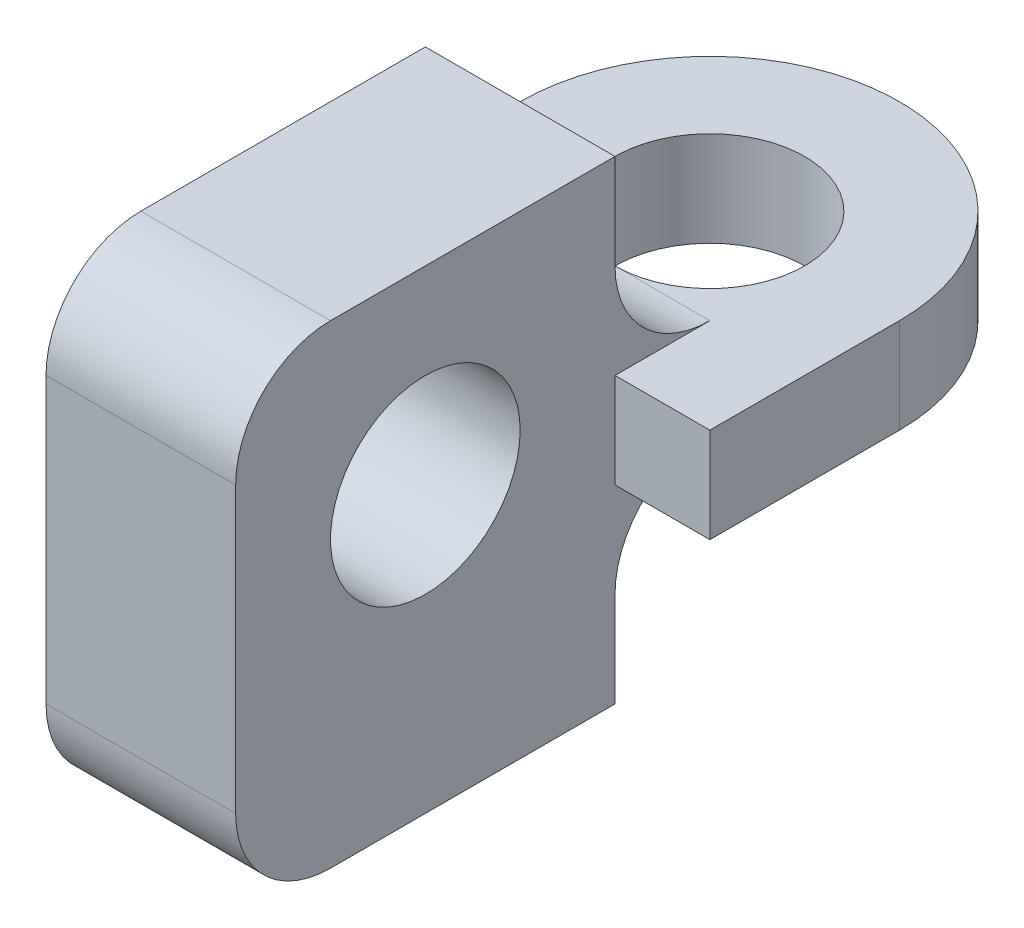
ISO-10303-21;
HEADER;
FILE_DESCRIPTION(('STEP AP214'),'2;1');
FILE_NAME('part.step','',(''),(''),'','','');
FILE_SCHEMA(('AUTOMOTIVE_DESIGN { 1 0 10303 214 1 1 1 1 }'));
ENDSEC;
DATA;
#1=APPLICATION_CONTEXT('core data for automotive mechanical design processes');
#2=APPLICATION_PROTOCOL_DEFINITION('international standard','automotive_design',2000,#1);
#3=PRODUCT_CONTEXT('',#1,'mechanical');
#4=PRODUCT('Part','Part','',(#3));
#5=PRODUCT_RELATED_PRODUCT_CATEGORY('part','',(#4));
#6=PRODUCT_DEFINITION_FORMATION('','',#4);
#7=PRODUCT_DEFINITION_CONTEXT('part definition',#1,'design');
#8=PRODUCT_DEFINITION('design','',#6,#7);
#9=PRODUCT_DEFINITION_SHAPE('','',#8);
#10=(LENGTH_UNIT() NAMED_UNIT(*) SI_UNIT(.MILLI.,.METRE.));
#11=(NAMED_UNIT(*) PLANE_ANGLE_UNIT() SI_UNIT($,.RADIAN.));
#12=(NAMED_UNIT(*) SI_UNIT($,.STERADIAN.) SOLID_ANGLE_UNIT());
#13=UNCERTAINTY_MEASURE_WITH_UNIT(LENGTH_MEASURE(1.E-05),#10,'distance_accuracy_value','');
#14=(GEOMETRIC_REPRESENTATION_CONTEXT(3) GLOBAL_UNCERTAINTY_ASSIGNED_CONTEXT((#13)) GLOBAL_UNIT_ASSIGNED_CONTEXT((#10,
#11,#12)) REPRESENTATION_CONTEXT('',''));
#15=CARTESIAN_POINT('',(0.,0.,0.));
#16=DIRECTION('',(0.,0.,1.));
#17=DIRECTION('',(1.,0.,0.));
#18=AXIS2_PLACEMENT_3D('',#15,#16,#17);
#19=CARTESIAN_POINT('',(20.,0.,-40.));
#20=DIRECTION('',(0.,0.,1.));
#21=DIRECTION('',(1.,0.,0.));
#22=AXIS2_PLACEMENT_3D('',#19,#20,#21);
#23=PLANE('',#22);
#24=DIRECTION('',(0.,1.,0.));
#25=VECTOR('',#24,1.);
#26=CARTESIAN_POINT('',(20.,0.,-40.));
#27=LINE('',#26,#25);
#28=CARTESIAN_POINT('',(20.,40.,-40.));
#29=VERTEX_POINT('',#28);
#30=CARTESIAN_POINT('',(20.,50.,-40.));
#31=VERTEX_POINT('',#30);
#32=EDGE_CURVE('E235',#29,#31,#27,.T.);
#33=ORIENTED_EDGE('',*,*,#32,.F.);
#34=DIRECTION('',(1.,0.,0.));
#35=VECTOR('',#34,1.);
#36=CARTESIAN_POINT('',(20.,40.,-40.));
#37=LINE('',#36,#35);
#38=CARTESIAN_POINT('',(0.,40.,-40.));
#39=VERTEX_POINT('',#38);
#40=EDGE_CURVE('E309',#29,#39,#37,.F.);
#41=ORIENTED_EDGE('',*,*,#40,.T.);
#42=DIRECTION('',(0.,1.,0.));
#43=VECTOR('',#42,1.);
#44=CARTESIAN_POINT('',(0.,0.,-40.));
#45=LINE('',#44,#43);
#46=CARTESIAN_POINT('',(0.,50.,-40.));
#47=VERTEX_POINT('',#46);
#48=EDGE_CURVE('E226',#39,#47,#45,.T.);
#49=ORIENTED_EDGE('',*,*,#48,.T.);
#50=DIRECTION('',(-1.,0.,0.));
#51=VECTOR('',#50,1.);
#52=CARTESIAN_POINT('',(20.,50.,-40.));
#53=LINE('',#52,#51);
#54=EDGE_CURVE('E290',#31,#47,#53,.T.);
#55=ORIENTED_EDGE('',*,*,#54,.F.);
#56=EDGE_LOOP('',(#33,#41,#49,#55));
#57=FACE_BOUND('',#56,.T.);
#58=ADVANCED_FACE('F43',(#57),#23,.F.);
#59=CARTESIAN_POINT('',(0.,0.,-40.));
#60=VERTEX_POINT('',#59);
#61=CARTESIAN_POINT('',(0.,10.,-40.));
#62=VERTEX_POINT('',#61);
#63=EDGE_CURVE('E251',#60,#62,#45,.T.);
#64=ORIENTED_EDGE('',*,*,#63,.T.);
#65=DIRECTION('',(1.,0.,0.));
#66=VECTOR('',#65,1.);
#67=CARTESIAN_POINT('',(20.,10.,-40.));
#68=LINE('',#67,#66);
#69=CARTESIAN_POINT('',(20.,10.,-40.));
#70=VERTEX_POINT('',#69);
#71=EDGE_CURVE('E318',#62,#70,#68,.T.);
#72=ORIENTED_EDGE('',*,*,#71,.T.);
#73=CARTESIAN_POINT('',(20.,0.,-40.));
#74=VERTEX_POINT('',#73);
#75=EDGE_CURVE('E230',#74,#70,#27,.T.);
#76=ORIENTED_EDGE('',*,*,#75,.F.);
#77=DIRECTION('',(-1.,0.,0.));
#78=VECTOR('',#77,1.);
#79=CARTESIAN_POINT('',(20.,0.,-40.));
#80=LINE('',#79,#78);
#81=EDGE_CURVE('E250',#74,#60,#80,.T.);
#82=ORIENTED_EDGE('',*,*,#81,.T.);
#83=EDGE_LOOP('',(#64,#72,#76,#82));
#84=FACE_BOUND('',#83,.T.);
#85=ADVANCED_FACE('F397',(#84),#23,.F.);
#86=CARTESIAN_POINT('',(20.,50.,-10.0000000000001));
#87=DIRECTION('',(0.,-1.,0.));
#88=DIRECTION('',(0.,0.,-1.));
#89=AXIS2_PLACEMENT_3D('',#86,#87,#88);
#90=PLANE('',#89);
#91=DIRECTION('',(0.,0.,1.));
#92=VECTOR('',#91,1.);
#93=CARTESIAN_POINT('',(0.,50.,-10.0000000000001));
#94=LINE('',#93,#92);
#95=CARTESIAN_POINT('',(0.,50.,-10.0000000000001));
#96=VERTEX_POINT('',#95);
#97=EDGE_CURVE('E255',#47,#96,#94,.T.);
#98=ORIENTED_EDGE('',*,*,#97,.T.);
#99=DIRECTION('',(-1.,0.,0.));
#100=VECTOR('',#99,1.);
#101=CARTESIAN_POINT('',(20.,50.,-10.0000000000001));
#102=LINE('',#101,#100);
#103=CARTESIAN_POINT('',(20.,50.,-10.0000000000001));
#104=VERTEX_POINT('',#103);
#105=EDGE_CURVE('E286',#104,#96,#102,.T.);
#106=ORIENTED_EDGE('',*,*,#105,.F.);
#107=DIRECTION('',(0.,0.,1.));
#108=VECTOR('',#107,1.);
#109=CARTESIAN_POINT('',(20.,50.,-10.0000000000001));
#110=LINE('',#109,#108);
#111=EDGE_CURVE('E233',#31,#104,#110,.T.);
#112=ORIENTED_EDGE('',*,*,#111,.F.);
#113=ORIENTED_EDGE('',*,*,#54,.T.);
#114=EDGE_LOOP('',(#98,#106,#112,#113));
#115=FACE_BOUND('',#114,.T.);
#116=ADVANCED_FACE('F372',(#115),#90,.F.);
#117=CARTESIAN_POINT('',(20.,40.,-10.));
#118=DIRECTION('',(-1.,0.,0.));
#119=DIRECTION('',(0.,0.,1.));
#120=AXIS2_PLACEMENT_3D('',#117,#118,#119);
#121=CYLINDRICAL_SURFACE('',#120,10.);
#122=CARTESIAN_POINT('',(0.,40.,-10.));
#123=DIRECTION('',(1.,0.,0.));
#124=DIRECTION('',(0.,0.,-1.));
#125=AXIS2_PLACEMENT_3D('',#122,#123,#124);
#126=CIRCLE('',#125,10.);
#127=CARTESIAN_POINT('',(0.,39.9999999999999,0.));
#128=VERTEX_POINT('',#127);
#129=EDGE_CURVE('E259',#96,#128,#126,.T.);
#130=ORIENTED_EDGE('',*,*,#129,.T.);
#131=DIRECTION('',(-1.,0.,0.));
#132=VECTOR('',#131,1.);
#133=CARTESIAN_POINT('',(20.,39.9999999999999,0.));
#134=LINE('',#133,#132);
#135=CARTESIAN_POINT('',(20.,39.9999999999999,0.));
#136=VERTEX_POINT('',#135);
#137=EDGE_CURVE('E282',#136,#128,#134,.T.);
#138=ORIENTED_EDGE('',*,*,#137,.F.);
#139=CARTESIAN_POINT('',(20.,40.,-10.));
#140=DIRECTION('',(1.,0.,0.));
#141=DIRECTION('',(0.,0.,-1.));
#142=AXIS2_PLACEMENT_3D('',#139,#140,#141);
#143=CIRCLE('',#142,10.);
#144=EDGE_CURVE('E238',#104,#136,#143,.T.);
#145=ORIENTED_EDGE('',*,*,#144,.F.);
#146=ORIENTED_EDGE('',*,*,#105,.T.);
#147=EDGE_LOOP('',(#130,#138,#145,#146));
#148=FACE_BOUND('',#147,.T.);
#149=ADVANCED_FACE('F379',(#148),#121,.T.);
#150=CARTESIAN_POINT('',(20.,10.0000000000001,0.));
#151=DIRECTION('',(0.,0.,-1.));
#152=DIRECTION('',(-1.,0.,0.));
#153=AXIS2_PLACEMENT_3D('',#150,#151,#152);
#154=PLANE('',#153);
#155=DIRECTION('',(0.,-1.,0.));
#156=VECTOR('',#155,1.);
#157=CARTESIAN_POINT('',(0.,10.0000000000001,0.));
#158=LINE('',#157,#156);
#159=CARTESIAN_POINT('',(0.,10.0000000000001,0.));
#160=VERTEX_POINT('',#159);
#161=EDGE_CURVE('E262',#128,#160,#158,.T.);
#162=ORIENTED_EDGE('',*,*,#161,.T.);
#163=DIRECTION('',(-1.,0.,0.));
#164=VECTOR('',#163,1.);
#165=CARTESIAN_POINT('',(20.,10.0000000000001,0.));
#166=LINE('',#165,#164);
#167=CARTESIAN_POINT('',(20.,10.0000000000001,0.));
#168=VERTEX_POINT('',#167);
#169=EDGE_CURVE('E278',#168,#160,#166,.T.);
#170=ORIENTED_EDGE('',*,*,#169,.F.);
#171=DIRECTION('',(0.,-1.,0.));
#172=VECTOR('',#171,1.);
#173=CARTESIAN_POINT('',(20.,10.0000000000001,0.));
#174=LINE('',#173,#172);
#175=EDGE_CURVE('E241',#136,#168,#174,.T.);
#176=ORIENTED_EDGE('',*,*,#175,.F.);
#177=ORIENTED_EDGE('',*,*,#137,.T.);
#178=EDGE_LOOP('',(#162,#170,#176,#177));
#179=FACE_BOUND('',#178,.T.);
#180=ADVANCED_FACE('F383',(#179),#154,.F.);
#181=CARTESIAN_POINT('',(20.,10.,-10.));
#182=DIRECTION('',(-1.,0.,0.));
#183=DIRECTION('',(0.,0.,1.));
#184=AXIS2_PLACEMENT_3D('',#181,#182,#183);
#185=CYLINDRICAL_SURFACE('',#184,10.);
#186=CARTESIAN_POINT('',(0.,10.,-10.));
#187=DIRECTION('',(1.,0.,0.));
#188=DIRECTION('',(0.,0.,-1.));
#189=AXIS2_PLACEMENT_3D('',#186,#187,#188);
#190=CIRCLE('',#189,10.);
#191=CARTESIAN_POINT('',(0.,0.,-10.0000000000001));
#192=VERTEX_POINT('',#191);
#193=EDGE_CURVE('E265',#160,#192,#190,.T.);
#194=ORIENTED_EDGE('',*,*,#193,.T.);
#195=DIRECTION('',(-1.,0.,0.));
#196=VECTOR('',#195,1.);
#197=CARTESIAN_POINT('',(20.,0.,-10.0000000000001));
#198=LINE('',#197,#196);
#199=CARTESIAN_POINT('',(20.,0.,-10.0000000000001));
#200=VERTEX_POINT('',#199);
#201=EDGE_CURVE('E274',#200,#192,#198,.T.);
#202=ORIENTED_EDGE('',*,*,#201,.F.);
#203=CARTESIAN_POINT('',(20.,10.,-10.));
#204=DIRECTION('',(1.,0.,0.));
#205=DIRECTION('',(0.,0.,-1.));
#206=AXIS2_PLACEMENT_3D('',#203,#204,#205);
#207=CIRCLE('',#206,10.);
#208=EDGE_CURVE('E244',#168,#200,#207,.T.);
#209=ORIENTED_EDGE('',*,*,#208,.F.);
#210=ORIENTED_EDGE('',*,*,#169,.T.);
#211=EDGE_LOOP('',(#194,#202,#209,#210));
#212=FACE_BOUND('',#211,.T.);
#213=ADVANCED_FACE('F388',(#212),#185,.T.);
#214=CARTESIAN_POINT('',(20.,0.,-10.0000000000001));
#215=DIRECTION('',(0.,1.,0.));
#216=DIRECTION('',(0.,0.,1.));
#217=AXIS2_PLACEMENT_3D('',#214,#215,#216);
#218=PLANE('',#217);
#219=DIRECTION('',(0.,0.,-1.));
#220=VECTOR('',#219,1.);
#221=CARTESIAN_POINT('',(0.,0.,-10.0000000000001));
#222=LINE('',#221,#220);
#223=EDGE_CURVE('E268',#192,#60,#222,.T.);
#224=ORIENTED_EDGE('',*,*,#223,.T.);
#225=ORIENTED_EDGE('',*,*,#81,.F.);
#226=DIRECTION('',(0.,0.,-1.));
#227=VECTOR('',#226,1.);
#228=CARTESIAN_POINT('',(20.,0.,-10.0000000000001));
#229=LINE('',#228,#227);
#230=EDGE_CURVE('E247',#200,#74,#229,.T.);
#231=ORIENTED_EDGE('',*,*,#230,.F.);
#232=ORIENTED_EDGE('',*,*,#201,.T.);
#233=EDGE_LOOP('',(#224,#225,#231,#232));
#234=FACE_BOUND('',#233,.T.);
#235=ADVANCED_FACE('F393',(#234),#218,.F.);
#236=CARTESIAN_POINT('',(20.,40.,-10.));
#237=DIRECTION('',(1.,0.,0.));
#238=DIRECTION('',(0.,0.,-1.));
#239=AXIS2_PLACEMENT_3D('',#236,#237,#238);
#240=PLANE('',#239);
#241=CARTESIAN_POINT('',(20.,30.,-20.));
#242=DIRECTION('',(1.,0.,0.));
#243=DIRECTION('',(0.,0.,-1.));
#244=AXIS2_PLACEMENT_3D('',#241,#242,#243);
#245=CIRCLE('',#244,10.);
#246=CARTESIAN_POINT('',(20.,30.,-30.));
#247=VERTEX_POINT('',#246);
#248=EDGE_CURVE('E215',#247,#247,#245,.T.);
#249=ORIENTED_EDGE('',*,*,#248,.F.);
#250=EDGE_LOOP('',(#249));
#251=FACE_BOUND('',#250,.T.);
#252=ORIENTED_EDGE('',*,*,#75,.T.);
#253=CARTESIAN_POINT('',(20.,10.,-50.));
#254=DIRECTION('',(1.,0.,0.));
#255=DIRECTION('',(0.,0.,-1.));
#256=AXIS2_PLACEMENT_3D('',#253,#254,#255);
#257=CIRCLE('',#256,10.);
#258=CARTESIAN_POINT('',(20.,20.,-50.));
#259=VERTEX_POINT('',#258);
#260=EDGE_CURVE('E52',#70,#259,#257,.F.);
#261=ORIENTED_EDGE('',*,*,#260,.T.);
#262=DIRECTION('',(0.,0.,-1.));
#263=VECTOR('',#262,1.);
#264=CARTESIAN_POINT('',(20.,20.,-60.));
#265=LINE('',#264,#263);
#266=CARTESIAN_POINT('',(20.,20.,-40.));
#267=VERTEX_POINT('',#266);
#268=EDGE_CURVE('E59',#267,#259,#265,.T.);
#269=ORIENTED_EDGE('',*,*,#268,.F.);
#270=CARTESIAN_POINT('',(20.,30.,-40.));
#271=VERTEX_POINT('',#270);
#272=EDGE_CURVE('E234',#267,#271,#27,.T.);
#273=ORIENTED_EDGE('',*,*,#272,.T.);
#274=DIRECTION('',(0.,0.,1.));
#275=VECTOR('',#274,1.);
#276=CARTESIAN_POINT('',(20.,30.,-10.));
#277=LINE('',#276,#275);
#278=CARTESIAN_POINT('',(20.,30.,-50.));
#279=VERTEX_POINT('',#278);
#280=EDGE_CURVE('E306',#279,#271,#277,.T.);
#281=ORIENTED_EDGE('',*,*,#280,.F.);
#282=CARTESIAN_POINT('',(20.,40.,-50.));
#283=DIRECTION('',(1.,0.,0.));
#284=DIRECTION('',(0.,0.,-1.));
#285=AXIS2_PLACEMENT_3D('',#282,#283,#284);
#286=CIRCLE('',#285,10.);
#287=EDGE_CURVE('E312',#279,#29,#286,.F.);
#288=ORIENTED_EDGE('',*,*,#287,.T.);
#289=ORIENTED_EDGE('',*,*,#32,.T.);
#290=ORIENTED_EDGE('',*,*,#111,.T.);
#291=ORIENTED_EDGE('',*,*,#144,.T.);
#292=ORIENTED_EDGE('',*,*,#175,.T.);
#293=ORIENTED_EDGE('',*,*,#208,.T.);
#294=ORIENTED_EDGE('',*,*,#230,.T.);
#295=EDGE_LOOP('',(#252,#261,#269,#273,#281,#288,#289,#290,#291,#292,#293,#294));
#296=FACE_BOUND('',#295,.T.);
#297=ADVANCED_FACE('F365',(#251,#296),#240,.T.);
#298=CARTESIAN_POINT('',(0.,40.,-10.));
#299=DIRECTION('',(1.,0.,0.));
#300=DIRECTION('',(0.,0.,-1.));
#301=AXIS2_PLACEMENT_3D('',#298,#299,#300);
#302=PLANE('',#301);
#303=CARTESIAN_POINT('',(0.,30.,-20.));
#304=DIRECTION('',(1.,0.,0.));
#305=DIRECTION('',(0.,0.,-1.));
#306=AXIS2_PLACEMENT_3D('',#303,#304,#305);
#307=CIRCLE('',#306,10.);
#308=CARTESIAN_POINT('',(0.,30.,-30.));
#309=VERTEX_POINT('',#308);
#310=EDGE_CURVE('E222',#309,#309,#307,.T.);
#311=ORIENTED_EDGE('',*,*,#310,.T.);
#312=EDGE_LOOP('',(#311));
#313=FACE_BOUND('',#312,.T.);
#314=ORIENTED_EDGE('',*,*,#63,.F.);
#315=ORIENTED_EDGE('',*,*,#223,.F.);
#316=ORIENTED_EDGE('',*,*,#193,.F.);
#317=ORIENTED_EDGE('',*,*,#161,.F.);
#318=ORIENTED_EDGE('',*,*,#129,.F.);
#319=ORIENTED_EDGE('',*,*,#97,.F.);
#320=ORIENTED_EDGE('',*,*,#48,.F.);
#321=CARTESIAN_POINT('',(0.,40.,-50.));
#322=DIRECTION('',(1.,0.,0.));
#323=DIRECTION('',(0.,0.,-1.));
#324=AXIS2_PLACEMENT_3D('',#321,#322,#323);
#325=CIRCLE('',#324,10.);
#326=CARTESIAN_POINT('',(0.,30.,-50.));
#327=VERTEX_POINT('',#326);
#328=EDGE_CURVE('E315',#39,#327,#325,.T.);
#329=ORIENTED_EDGE('',*,*,#328,.T.);
#330=DIRECTION('',(0.,0.,-1.));
#331=VECTOR('',#330,1.);
#332=CARTESIAN_POINT('',(0.,30.,-60.));
#333=LINE('',#332,#331);
#334=CARTESIAN_POINT('',(0.,30.,-40.));
#335=VERTEX_POINT('',#334);
#336=EDGE_CURVE('E294',#335,#327,#333,.T.);
#337=ORIENTED_EDGE('',*,*,#336,.F.);
#338=CARTESIAN_POINT('',(0.,20.,-40.));
#339=VERTEX_POINT('',#338);
#340=EDGE_CURVE('E256',#339,#335,#45,.T.);
#341=ORIENTED_EDGE('',*,*,#340,.F.);
#342=DIRECTION('',(0.,0.,1.));
#343=VECTOR('',#342,1.);
#344=CARTESIAN_POINT('',(0.,20.,-10.));
#345=LINE('',#344,#343);
#346=CARTESIAN_POINT('',(0.,20.,-50.));
#347=VERTEX_POINT('',#346);
#348=EDGE_CURVE('E322',#347,#339,#345,.T.);
#349=ORIENTED_EDGE('',*,*,#348,.F.);
#350=CARTESIAN_POINT('',(0.,10.,-50.));
#351=DIRECTION('',(1.,0.,0.));
#352=DIRECTION('',(0.,0.,-1.));
#353=AXIS2_PLACEMENT_3D('',#350,#351,#352);
#354=CIRCLE('',#353,10.);
#355=EDGE_CURVE('E11',#347,#62,#354,.T.);
#356=ORIENTED_EDGE('',*,*,#355,.T.);
#357=EDGE_LOOP('',(#314,#315,#316,#317,#318,#319,#320,#329,#337,#341,#349,#356));
#358=FACE_BOUND('',#357,.T.);
#359=ADVANCED_FACE('F429',(#313,#358),#302,.F.);
#360=CARTESIAN_POINT('',(0.,30.,-20.));
#361=DIRECTION('',(1.,0.,0.));
#362=DIRECTION('',(0.,0.,-1.));
#363=AXIS2_PLACEMENT_3D('',#360,#361,#362);
#364=CYLINDRICAL_SURFACE('',#363,10.);
#365=ORIENTED_EDGE('',*,*,#310,.F.);
#366=EDGE_LOOP('',(#365));
#367=FACE_BOUND('',#366,.T.);
#368=ORIENTED_EDGE('',*,*,#248,.T.);
#369=EDGE_LOOP('',(#368));
#370=FACE_BOUND('',#369,.T.);
#371=ADVANCED_FACE('F432',(#367,#370),#364,.F.);
#372=CARTESIAN_POINT('',(-10.,20.,-40.));
#373=DIRECTION('',(0.,0.,1.));
#374=DIRECTION('',(1.,0.,0.));
#375=AXIS2_PLACEMENT_3D('',#372,#373,#374);
#376=PLANE('',#375);
#377=ORIENTED_EDGE('',*,*,#272,.F.);
#378=DIRECTION('',(1.,0.,0.));
#379=VECTOR('',#378,1.);
#380=CARTESIAN_POINT('',(-10.,20.,-40.));
#381=LINE('',#380,#379);
#382=CARTESIAN_POINT('',(30.,20.,-40.));
#383=VERTEX_POINT('',#382);
#384=EDGE_CURVE('E184',#267,#383,#381,.T.);
#385=ORIENTED_EDGE('',*,*,#384,.T.);
#386=DIRECTION('',(0.,1.,0.));
#387=VECTOR('',#386,1.);
#388=CARTESIAN_POINT('',(30.,20.,-40.));
#389=LINE('',#388,#387);
#390=CARTESIAN_POINT('',(30.,30.,-40.));
#391=VERTEX_POINT('',#390);
#392=EDGE_CURVE('E216',#383,#391,#389,.T.);
#393=ORIENTED_EDGE('',*,*,#392,.T.);
#394=DIRECTION('',(1.,0.,0.));
#395=VECTOR('',#394,1.);
#396=CARTESIAN_POINT('',(-10.,30.,-40.));
#397=LINE('',#396,#395);
#398=EDGE_CURVE('E209',#271,#391,#397,.T.);
#399=ORIENTED_EDGE('',*,*,#398,.F.);
#400=EDGE_LOOP('',(#377,#385,#393,#399));
#401=FACE_BOUND('',#400,.T.);
#402=ADVANCED_FACE('F343',(#401),#376,.T.);
#403=CARTESIAN_POINT('',(10.,20.,-60.));
#404=DIRECTION('',(0.,1.,0.));
#405=DIRECTION('',(0.,0.,1.));
#406=AXIS2_PLACEMENT_3D('',#403,#404,#405);
#407=CYLINDRICAL_SURFACE('',#406,20.);
#408=CARTESIAN_POINT('',(10.,30.,-60.));
#409=DIRECTION('',(0.,1.,0.));
#410=DIRECTION('',(0.,0.,1.));
#411=AXIS2_PLACEMENT_3D('',#408,#409,#410);
#412=CIRCLE('',#411,20.);
#413=CARTESIAN_POINT('',(30.,30.,-60.));
#414=VERTEX_POINT('',#413);
#415=CARTESIAN_POINT('',(-10.,30.,-60.));
#416=VERTEX_POINT('',#415);
#417=EDGE_CURVE('E203',#414,#416,#412,.T.);
#418=ORIENTED_EDGE('',*,*,#417,.F.);
#419=DIRECTION('',(0.,1.,0.));
#420=VECTOR('',#419,1.);
#421=CARTESIAN_POINT('',(30.,20.,-60.));
#422=LINE('',#421,#420);
#423=CARTESIAN_POINT('',(30.,20.,-60.));
#424=VERTEX_POINT('',#423);
#425=EDGE_CURVE('E187',#424,#414,#422,.T.);
#426=ORIENTED_EDGE('',*,*,#425,.F.);
#427=CARTESIAN_POINT('',(10.,20.,-60.));
#428=DIRECTION('',(0.,1.,0.));
#429=DIRECTION('',(0.,0.,1.));
#430=AXIS2_PLACEMENT_3D('',#427,#428,#429);
#431=CIRCLE('',#430,20.);
#432=CARTESIAN_POINT('',(-10.,20.,-60.));
#433=VERTEX_POINT('',#432);
#434=EDGE_CURVE('E179',#424,#433,#431,.T.);
#435=ORIENTED_EDGE('',*,*,#434,.T.);
#436=DIRECTION('',(0.,1.,0.));
#437=VECTOR('',#436,1.);
#438=CARTESIAN_POINT('',(-10.,20.,-60.));
#439=LINE('',#438,#437);
#440=EDGE_CURVE('E160',#433,#416,#439,.T.);
#441=ORIENTED_EDGE('',*,*,#440,.T.);
#442=EDGE_LOOP('',(#418,#426,#435,#441));
#443=FACE_BOUND('',#442,.T.);
#444=ADVANCED_FACE('F186',(#443),#407,.T.);
#445=CARTESIAN_POINT('',(30.,20.,-40.));
#446=DIRECTION('',(1.,0.,0.));
#447=DIRECTION('',(0.,0.,-1.));
#448=AXIS2_PLACEMENT_3D('',#445,#446,#447);
#449=PLANE('',#448);
#450=DIRECTION('',(0.,0.,-1.));
#451=VECTOR('',#450,1.);
#452=CARTESIAN_POINT('',(30.,30.,-40.));
#453=LINE('',#452,#451);
#454=EDGE_CURVE('E189',#391,#414,#453,.T.);
#455=ORIENTED_EDGE('',*,*,#454,.F.);
#456=ORIENTED_EDGE('',*,*,#392,.F.);
#457=DIRECTION('',(0.,0.,-1.));
#458=VECTOR('',#457,1.);
#459=CARTESIAN_POINT('',(30.,20.,-40.));
#460=LINE('',#459,#458);
#461=EDGE_CURVE('E172',#383,#424,#460,.T.);
#462=ORIENTED_EDGE('',*,*,#461,.T.);
#463=ORIENTED_EDGE('',*,*,#425,.T.);
#464=EDGE_LOOP('',(#455,#456,#462,#463));
#465=FACE_BOUND('',#464,.T.);
#466=ADVANCED_FACE('F347',(#465),#449,.T.);
#467=CARTESIAN_POINT('',(-10.,20.,-40.));
#468=VERTEX_POINT('',#467);
#469=EDGE_CURVE('E182',#468,#339,#381,.T.);
#470=ORIENTED_EDGE('',*,*,#469,.T.);
#471=ORIENTED_EDGE('',*,*,#340,.T.);
#472=CARTESIAN_POINT('',(-10.,30.,-40.));
#473=VERTEX_POINT('',#472);
#474=EDGE_CURVE('E193',#473,#335,#397,.T.);
#475=ORIENTED_EDGE('',*,*,#474,.F.);
#476=DIRECTION('',(0.,1.,0.));
#477=VECTOR('',#476,1.);
#478=CARTESIAN_POINT('',(-10.,20.,-40.));
#479=LINE('',#478,#477);
#480=EDGE_CURVE('E171',#468,#473,#479,.T.);
#481=ORIENTED_EDGE('',*,*,#480,.F.);
#482=EDGE_LOOP('',(#470,#471,#475,#481));
#483=FACE_BOUND('',#482,.T.);
#484=ADVANCED_FACE('F444',(#483),#376,.T.);
#485=CARTESIAN_POINT('',(-10.,20.,-60.));
#486=DIRECTION('',(-1.,0.,0.));
#487=DIRECTION('',(0.,0.,1.));
#488=AXIS2_PLACEMENT_3D('',#485,#486,#487);
#489=PLANE('',#488);
#490=DIRECTION('',(0.,0.,1.));
#491=VECTOR('',#490,1.);
#492=CARTESIAN_POINT('',(-10.,30.,-60.));
#493=LINE('',#492,#491);
#494=EDGE_CURVE('E165',#416,#473,#493,.T.);
#495=ORIENTED_EDGE('',*,*,#494,.F.);
#496=ORIENTED_EDGE('',*,*,#440,.F.);
#497=DIRECTION('',(0.,0.,1.));
#498=VECTOR('',#497,1.);
#499=CARTESIAN_POINT('',(-10.,20.,-60.));
#500=LINE('',#499,#498);
#501=EDGE_CURVE('E163',#433,#468,#500,.T.);
#502=ORIENTED_EDGE('',*,*,#501,.T.);
#503=ORIENTED_EDGE('',*,*,#480,.T.);
#504=EDGE_LOOP('',(#495,#496,#502,#503));
#505=FACE_BOUND('',#504,.T.);
#506=ADVANCED_FACE('F162',(#505),#489,.T.);
#507=CARTESIAN_POINT('',(10.,20.,-60.));
#508=DIRECTION('',(0.,1.,0.));
#509=DIRECTION('',(0.,0.,1.));
#510=AXIS2_PLACEMENT_3D('',#507,#508,#509);
#511=PLANE('',#510);
#512=ORIENTED_EDGE('',*,*,#384,.F.);
#513=ORIENTED_EDGE('',*,*,#268,.T.);
#514=DIRECTION('',(1.,0.,0.));
#515=VECTOR('',#514,1.);
#516=CARTESIAN_POINT('',(0.,20.,-50.));
#517=LINE('',#516,#515);
#518=CARTESIAN_POINT('',(10.,20.,-50.));
#519=VERTEX_POINT('',#518);
#520=EDGE_CURVE('E329',#259,#519,#517,.F.);
#521=ORIENTED_EDGE('',*,*,#520,.T.);
#522=CARTESIAN_POINT('',(10.,20.,-60.));
#523=DIRECTION('',(0.,1.,0.));
#524=DIRECTION('',(0.,0.,1.));
#525=AXIS2_PLACEMENT_3D('',#522,#523,#524);
#526=CIRCLE('',#525,10.);
#527=EDGE_CURVE('E206',#519,#519,#526,.T.);
#528=ORIENTED_EDGE('',*,*,#527,.T.);
#529=DIRECTION('',(1.,0.,0.));
#530=VECTOR('',#529,1.);
#531=CARTESIAN_POINT('',(0.,20.,-50.));
#532=LINE('',#531,#530);
#533=EDGE_CURVE('E325',#519,#347,#532,.F.);
#534=ORIENTED_EDGE('',*,*,#533,.T.);
#535=ORIENTED_EDGE('',*,*,#348,.T.);
#536=ORIENTED_EDGE('',*,*,#469,.F.);
#537=ORIENTED_EDGE('',*,*,#501,.F.);
#538=ORIENTED_EDGE('',*,*,#434,.F.);
#539=ORIENTED_EDGE('',*,*,#461,.F.);
#540=EDGE_LOOP('',(#512,#513,#521,#528,#534,#535,#536,#537,#538,#539));
#541=FACE_BOUND('',#540,.T.);
#542=ADVANCED_FACE('F177',(#541),#511,.F.);
#543=CARTESIAN_POINT('',(10.,30.,-60.));
#544=DIRECTION('',(0.,1.,0.));
#545=DIRECTION('',(0.,0.,1.));
#546=AXIS2_PLACEMENT_3D('',#543,#544,#545);
#547=PLANE('',#546);
#548=DIRECTION('',(1.,0.,0.));
#549=VECTOR('',#548,1.);
#550=CARTESIAN_POINT('',(10.,30.,-50.));
#551=LINE('',#550,#549);
#552=CARTESIAN_POINT('',(10.,30.,-50.));
#553=VERTEX_POINT('',#552);
#554=EDGE_CURVE('E302',#553,#279,#551,.T.);
#555=ORIENTED_EDGE('',*,*,#554,.T.);
#556=ORIENTED_EDGE('',*,*,#280,.T.);
#557=ORIENTED_EDGE('',*,*,#398,.T.);
#558=ORIENTED_EDGE('',*,*,#454,.T.);
#559=ORIENTED_EDGE('',*,*,#417,.T.);
#560=ORIENTED_EDGE('',*,*,#494,.T.);
#561=ORIENTED_EDGE('',*,*,#474,.T.);
#562=ORIENTED_EDGE('',*,*,#336,.T.);
#563=DIRECTION('',(1.,0.,0.));
#564=VECTOR('',#563,1.);
#565=CARTESIAN_POINT('',(10.,30.,-50.));
#566=LINE('',#565,#564);
#567=EDGE_CURVE('E298',#327,#553,#566,.T.);
#568=ORIENTED_EDGE('',*,*,#567,.T.);
#569=CARTESIAN_POINT('',(10.,30.,-60.));
#570=DIRECTION('',(0.,1.,0.));
#571=DIRECTION('',(0.,0.,1.));
#572=AXIS2_PLACEMENT_3D('',#569,#570,#571);
#573=CIRCLE('',#572,10.);
#574=EDGE_CURVE('E196',#553,#553,#573,.T.);
#575=ORIENTED_EDGE('',*,*,#574,.F.);
#576=EDGE_LOOP('',(#555,#556,#557,#558,#559,#560,#561,#562,#568,#575));
#577=FACE_BOUND('',#576,.T.);
#578=ADVANCED_FACE('F349',(#577),#547,.T.);
#579=CARTESIAN_POINT('',(10.,20.,-60.));
#580=DIRECTION('',(0.,1.,0.));
#581=DIRECTION('',(0.,0.,1.));
#582=AXIS2_PLACEMENT_3D('',#579,#580,#581);
#583=CYLINDRICAL_SURFACE('',#582,10.);
#584=ORIENTED_EDGE('',*,*,#527,.F.);
#585=EDGE_LOOP('',(#584));
#586=FACE_BOUND('',#585,.T.);
#587=ORIENTED_EDGE('',*,*,#574,.T.);
#588=EDGE_LOOP('',(#587));
#589=FACE_BOUND('',#588,.T.);
#590=ADVANCED_FACE('F357',(#586,#589),#583,.F.);
#591=CARTESIAN_POINT('',(10.,40.,-50.));
#592=DIRECTION('',(1.,0.,0.));
#593=DIRECTION('',(0.,0.,-1.));
#594=AXIS2_PLACEMENT_3D('',#591,#592,#593);
#595=CYLINDRICAL_SURFACE('',#594,10.);
#596=ORIENTED_EDGE('',*,*,#328,.F.);
#597=ORIENTED_EDGE('',*,*,#40,.F.);
#598=ORIENTED_EDGE('',*,*,#287,.F.);
#599=ORIENTED_EDGE('',*,*,#554,.F.);
#600=ORIENTED_EDGE('',*,*,#567,.F.);
#601=EDGE_LOOP('',(#596,#597,#598,#599,#600));
#602=FACE_BOUND('',#601,.T.);
#603=ADVANCED_FACE('F362',(#602),#595,.F.);
#604=CARTESIAN_POINT('',(20.,10.,-50.));
#605=DIRECTION('',(-1.,0.,0.));
#606=DIRECTION('',(0.,0.,1.));
#607=AXIS2_PLACEMENT_3D('',#604,#605,#606);
#608=CYLINDRICAL_SURFACE('',#607,10.);
#609=ORIENTED_EDGE('',*,*,#533,.F.);
#610=ORIENTED_EDGE('',*,*,#520,.F.);
#611=ORIENTED_EDGE('',*,*,#260,.F.);
#612=ORIENTED_EDGE('',*,*,#71,.F.);
#613=ORIENTED_EDGE('',*,*,#355,.F.);
#614=EDGE_LOOP('',(#609,#610,#611,#612,#613));
#615=FACE_BOUND('',#614,.T.);
#616=ADVANCED_FACE('F45',(#615),#608,.F.);
#617=CLOSED_SHELL('',(#58,#85,#116,#149,#180,#213,#235,#297,#359,#371,#402,#444,#466,#484,#506,
#542,#578,#590,#603,#616));
#618=MANIFOLD_SOLID_BREP('B2',#617);
#619=ADVANCED_BREP_SHAPE_REPRESENTATION('',(#18,#618),#14);
#620=SHAPE_DEFINITION_REPRESENTATION(#9,#619);
ENDSEC;
END-ISO-10303-21;
